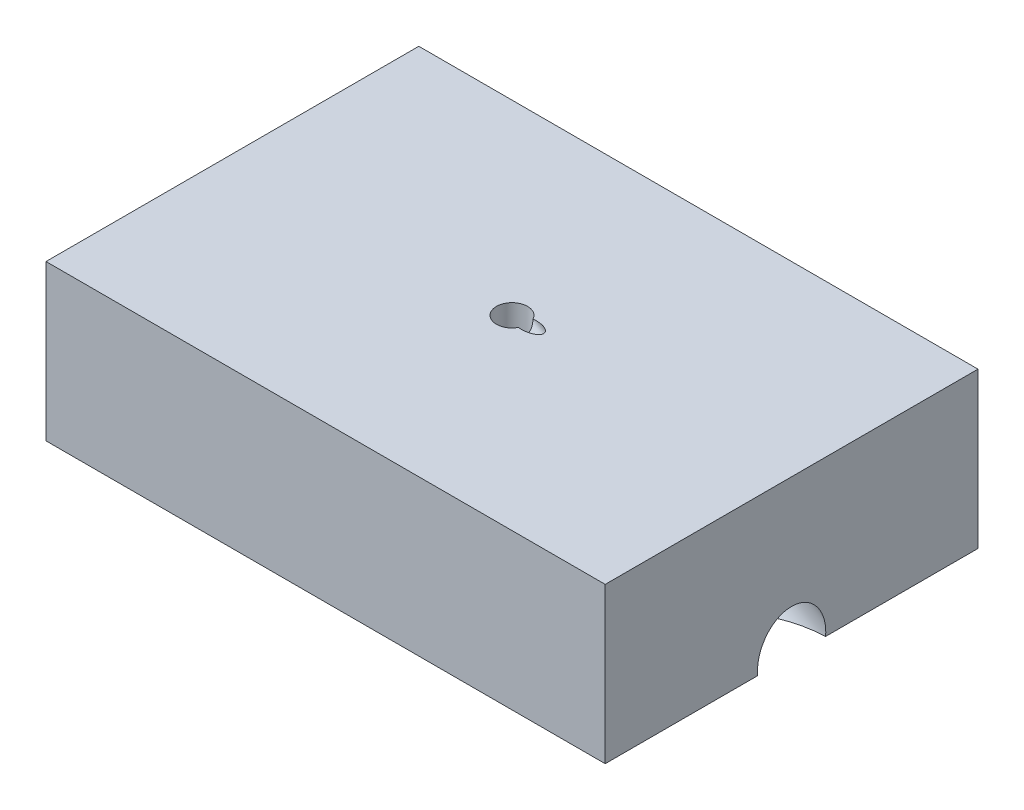
ISO-10303-21;
HEADER;
FILE_DESCRIPTION(('STEP AP214'),'2;1');
FILE_NAME('part.step','',(''),(''),'','','');
FILE_SCHEMA(('AUTOMOTIVE_DESIGN { 1 0 10303 214 1 1 1 1 }'));
ENDSEC;
DATA;
#1=APPLICATION_CONTEXT('core data for automotive mechanical design processes');
#2=APPLICATION_PROTOCOL_DEFINITION('international standard','automotive_design',2000,#1);
#3=PRODUCT_CONTEXT('',#1,'mechanical');
#4=PRODUCT('Part','Part','',(#3));
#5=PRODUCT_RELATED_PRODUCT_CATEGORY('part','',(#4));
#6=PRODUCT_DEFINITION_FORMATION('','',#4);
#7=PRODUCT_DEFINITION_CONTEXT('part definition',#1,'design');
#8=PRODUCT_DEFINITION('design','',#6,#7);
#9=PRODUCT_DEFINITION_SHAPE('','',#8);
#10=(LENGTH_UNIT() NAMED_UNIT(*) SI_UNIT(.MILLI.,.METRE.));
#11=(NAMED_UNIT(*) PLANE_ANGLE_UNIT() SI_UNIT($,.RADIAN.));
#12=(NAMED_UNIT(*) SI_UNIT($,.STERADIAN.) SOLID_ANGLE_UNIT());
#13=UNCERTAINTY_MEASURE_WITH_UNIT(LENGTH_MEASURE(1.E-05),#10,'distance_accuracy_value','');
#14=(GEOMETRIC_REPRESENTATION_CONTEXT(3) GLOBAL_UNCERTAINTY_ASSIGNED_CONTEXT((#13)) GLOBAL_UNIT_ASSIGNED_CONTEXT((#10,
#11,#12)) REPRESENTATION_CONTEXT('',''));
#15=CARTESIAN_POINT('',(0.,0.,0.));
#16=DIRECTION('',(0.,0.,1.));
#17=DIRECTION('',(1.,0.,0.));
#18=AXIS2_PLACEMENT_3D('',#15,#16,#17);
#19=CARTESIAN_POINT('',(-45.,25.,30.));
#20=DIRECTION('',(1.,0.,0.));
#21=DIRECTION('',(0.,0.,-1.));
#22=AXIS2_PLACEMENT_3D('',#19,#20,#21);
#23=PLANE('',#22);
#24=DIRECTION('',(0.,0.,1.));
#25=VECTOR('',#24,1.);
#26=CARTESIAN_POINT('',(-45.,0.,30.));
#27=LINE('',#26,#25);
#28=CARTESIAN_POINT('',(-45.,0.,-30.));
#29=VERTEX_POINT('',#28);
#30=CARTESIAN_POINT('',(-45.,0.,30.));
#31=VERTEX_POINT('',#30);
#32=EDGE_CURVE('E98',#29,#31,#27,.T.);
#33=ORIENTED_EDGE('',*,*,#32,.T.);
#34=DIRECTION('',(0.,-1.,0.));
#35=VECTOR('',#34,1.);
#36=CARTESIAN_POINT('',(-45.,25.,30.));
#37=LINE('',#36,#35);
#38=CARTESIAN_POINT('',(-45.,25.,30.));
#39=VERTEX_POINT('',#38);
#40=EDGE_CURVE('E42',#39,#31,#37,.T.);
#41=ORIENTED_EDGE('',*,*,#40,.F.);
#42=DIRECTION('',(0.,0.,1.));
#43=VECTOR('',#42,1.);
#44=CARTESIAN_POINT('',(-45.,25.,30.));
#45=LINE('',#44,#43);
#46=CARTESIAN_POINT('',(-45.,25.,-30.));
#47=VERTEX_POINT('',#46);
#48=EDGE_CURVE('E109',#47,#39,#45,.T.);
#49=ORIENTED_EDGE('',*,*,#48,.F.);
#50=DIRECTION('',(0.,-1.,0.));
#51=VECTOR('',#50,1.);
#52=CARTESIAN_POINT('',(-45.,25.,-30.));
#53=LINE('',#52,#51);
#54=EDGE_CURVE('E118',#47,#29,#53,.T.);
#55=ORIENTED_EDGE('',*,*,#54,.T.);
#56=EDGE_LOOP('',(#33,#41,#49,#55));
#57=FACE_BOUND('',#56,.T.);
#58=ADVANCED_FACE('F35',(#57),#23,.F.);
#59=CARTESIAN_POINT('',(45.,25.,30.));
#60=DIRECTION('',(0.,0.,-1.));
#61=DIRECTION('',(-1.,0.,0.));
#62=AXIS2_PLACEMENT_3D('',#59,#60,#61);
#63=PLANE('',#62);
#64=DIRECTION('',(1.,0.,0.));
#65=VECTOR('',#64,1.);
#66=CARTESIAN_POINT('',(45.,0.,30.));
#67=LINE('',#66,#65);
#68=CARTESIAN_POINT('',(45.,0.,30.));
#69=VERTEX_POINT('',#68);
#70=EDGE_CURVE('E102',#31,#69,#67,.T.);
#71=ORIENTED_EDGE('',*,*,#70,.T.);
#72=DIRECTION('',(0.,-1.,0.));
#73=VECTOR('',#72,1.);
#74=CARTESIAN_POINT('',(45.,25.,30.));
#75=LINE('',#74,#73);
#76=CARTESIAN_POINT('',(45.,25.,30.));
#77=VERTEX_POINT('',#76);
#78=EDGE_CURVE('E131',#77,#69,#75,.T.);
#79=ORIENTED_EDGE('',*,*,#78,.F.);
#80=DIRECTION('',(1.,0.,0.));
#81=VECTOR('',#80,1.);
#82=CARTESIAN_POINT('',(45.,25.,30.));
#83=LINE('',#82,#81);
#84=EDGE_CURVE('E112',#39,#77,#83,.T.);
#85=ORIENTED_EDGE('',*,*,#84,.F.);
#86=ORIENTED_EDGE('',*,*,#40,.T.);
#87=EDGE_LOOP('',(#71,#79,#85,#86));
#88=FACE_BOUND('',#87,.T.);
#89=ADVANCED_FACE('F136',(#88),#63,.F.);
#90=CARTESIAN_POINT('',(45.,25.,30.));
#91=DIRECTION('',(-1.,0.,0.));
#92=DIRECTION('',(0.,0.,1.));
#93=AXIS2_PLACEMENT_3D('',#90,#91,#92);
#94=PLANE('',#93);
#95=CARTESIAN_POINT('',(45.,0.577350269189422,0.));
#96=DIRECTION('',(-1.,0.,0.));
#97=DIRECTION('',(0.,-1.,0.));
#98=AXIS2_PLACEMENT_3D('',#95,#96,#97);
#99=ELLIPSE('',#98,6.3508529610859,5.5);
#100=CARTESIAN_POINT('',(45.,0.,-5.47722557505167));
#101=VERTEX_POINT('',#100);
#102=CARTESIAN_POINT('',(45.,0.,5.47722557505168));
#103=VERTEX_POINT('',#102);
#104=EDGE_CURVE('E54',#101,#103,#99,.F.);
#105=ORIENTED_EDGE('',*,*,#104,.F.);
#106=DIRECTION('',(0.,0.,-1.));
#107=VECTOR('',#106,1.);
#108=CARTESIAN_POINT('',(45.,0.,30.));
#109=LINE('',#108,#107);
#110=CARTESIAN_POINT('',(45.,0.,-30.));
#111=VERTEX_POINT('',#110);
#112=EDGE_CURVE('E121',#101,#111,#109,.T.);
#113=ORIENTED_EDGE('',*,*,#112,.T.);
#114=DIRECTION('',(0.,-1.,0.));
#115=VECTOR('',#114,1.);
#116=CARTESIAN_POINT('',(45.,25.,-30.));
#117=LINE('',#116,#115);
#118=CARTESIAN_POINT('',(45.,25.,-30.));
#119=VERTEX_POINT('',#118);
#120=EDGE_CURVE('E128',#119,#111,#117,.T.);
#121=ORIENTED_EDGE('',*,*,#120,.F.);
#122=DIRECTION('',(0.,0.,-1.));
#123=VECTOR('',#122,1.);
#124=CARTESIAN_POINT('',(45.,25.,30.));
#125=LINE('',#124,#123);
#126=EDGE_CURVE('E115',#77,#119,#125,.T.);
#127=ORIENTED_EDGE('',*,*,#126,.F.);
#128=ORIENTED_EDGE('',*,*,#78,.T.);
#129=EDGE_CURVE('E122',#69,#103,#109,.T.);
#130=ORIENTED_EDGE('',*,*,#129,.T.);
#131=EDGE_LOOP('',(#105,#113,#121,#127,#128,#130));
#132=FACE_BOUND('',#131,.T.);
#133=ADVANCED_FACE('F149',(#132),#94,.F.);
#134=CARTESIAN_POINT('',(45.,25.,-30.));
#135=DIRECTION('',(0.,0.,1.));
#136=DIRECTION('',(1.,0.,0.));
#137=AXIS2_PLACEMENT_3D('',#134,#135,#136);
#138=PLANE('',#137);
#139=DIRECTION('',(-1.,0.,0.));
#140=VECTOR('',#139,1.);
#141=CARTESIAN_POINT('',(45.,0.,-30.));
#142=LINE('',#141,#140);
#143=EDGE_CURVE('E113',#111,#29,#142,.T.);
#144=ORIENTED_EDGE('',*,*,#143,.T.);
#145=ORIENTED_EDGE('',*,*,#54,.F.);
#146=DIRECTION('',(-1.,0.,0.));
#147=VECTOR('',#146,1.);
#148=CARTESIAN_POINT('',(45.,25.,-30.));
#149=LINE('',#148,#147);
#150=EDGE_CURVE('E117',#119,#47,#149,.T.);
#151=ORIENTED_EDGE('',*,*,#150,.F.);
#152=ORIENTED_EDGE('',*,*,#120,.T.);
#153=EDGE_LOOP('',(#144,#145,#151,#152));
#154=FACE_BOUND('',#153,.T.);
#155=ADVANCED_FACE('F154',(#154),#138,.F.);
#156=CARTESIAN_POINT('',(0.,25.,0.));
#157=DIRECTION('',(0.,1.,0.));
#158=DIRECTION('',(0.,0.,1.));
#159=AXIS2_PLACEMENT_3D('',#156,#157,#158);
#160=PLANE('',#159);
#161=CARTESIAN_POINT('',(2.69872981077816,25.,0.));
#162=DIRECTION('',(0.,1.,0.));
#163=DIRECTION('',(1.,0.,0.));
#164=AXIS2_PLACEMENT_3D('',#161,#162,#163);
#165=ELLIPSE('',#164,2.39999999999998,1.2);
#166=CARTESIAN_POINT('',(2.20691427781334,25.,1.1745336820984));
#167=VERTEX_POINT('',#166);
#168=CARTESIAN_POINT('',(2.20691427781334,25.,-1.1745336820984));
#169=VERTEX_POINT('',#168);
#170=EDGE_CURVE('E48',#167,#169,#165,.T.);
#171=ORIENTED_EDGE('',*,*,#170,.F.);
#172=CARTESIAN_POINT('',(0.,25.,0.));
#173=DIRECTION('',(0.,1.,0.));
#174=DIRECTION('',(0.,0.,1.));
#175=AXIS2_PLACEMENT_3D('',#172,#173,#174);
#176=CIRCLE('',#175,2.5);
#177=EDGE_CURVE('E94',#169,#167,#176,.T.);
#178=ORIENTED_EDGE('',*,*,#177,.F.);
#179=EDGE_LOOP('',(#171,#178));
#180=FACE_BOUND('',#179,.T.);
#181=ORIENTED_EDGE('',*,*,#48,.T.);
#182=ORIENTED_EDGE('',*,*,#84,.T.);
#183=ORIENTED_EDGE('',*,*,#126,.T.);
#184=ORIENTED_EDGE('',*,*,#150,.T.);
#185=EDGE_LOOP('',(#181,#182,#183,#184));
#186=FACE_BOUND('',#185,.T.);
#187=ADVANCED_FACE('F92',(#180,#186),#160,.T.);
#188=CARTESIAN_POINT('',(0.,0.,0.));
#189=DIRECTION('',(0.,1.,0.));
#190=DIRECTION('',(0.,0.,1.));
#191=AXIS2_PLACEMENT_3D('',#188,#189,#190);
#192=PLANE('',#191);
#193=CARTESIAN_POINT('',(45.9999999999996,0.,0.));
#194=DIRECTION('',(0.,1.,0.));
#195=DIRECTION('',(1.,0.,0.));
#196=AXIS2_PLACEMENT_3D('',#193,#194,#195);
#197=ELLIPSE('',#196,10.9999999999999,5.5);
#198=EDGE_CURVE('E11',#103,#101,#197,.F.);
#199=ORIENTED_EDGE('',*,*,#198,.F.);
#200=ORIENTED_EDGE('',*,*,#129,.F.);
#201=ORIENTED_EDGE('',*,*,#70,.F.);
#202=ORIENTED_EDGE('',*,*,#32,.F.);
#203=ORIENTED_EDGE('',*,*,#143,.F.);
#204=ORIENTED_EDGE('',*,*,#112,.F.);
#205=EDGE_LOOP('',(#199,#200,#201,#202,#203,#204));
#206=FACE_BOUND('',#205,.T.);
#207=CARTESIAN_POINT('',(0.,0.,0.));
#208=DIRECTION('',(0.,1.,0.));
#209=DIRECTION('',(0.,0.,1.));
#210=AXIS2_PLACEMENT_3D('',#207,#208,#209);
#211=CIRCLE('',#210,6.75);
#212=CARTESIAN_POINT('',(0.,0.,6.75));
#213=VERTEX_POINT('',#212);
#214=EDGE_CURVE('E267',#213,#213,#211,.T.);
#215=ORIENTED_EDGE('',*,*,#214,.T.);
#216=EDGE_LOOP('',(#215));
#217=FACE_BOUND('',#216,.T.);
#218=ADVANCED_FACE('F144',(#206,#217),#192,.F.);
#219=CARTESIAN_POINT('',(0.,19.8,0.));
#220=DIRECTION('',(0.,1.,0.));
#221=DIRECTION('',(0.,0.,1.));
#222=AXIS2_PLACEMENT_3D('',#219,#220,#221);
#223=CYLINDRICAL_SURFACE('',#222,2.5);
#224=CARTESIAN_POINT('',(0.,19.8,0.));
#225=DIRECTION('',(0.,1.,0.));
#226=DIRECTION('',(0.,0.,1.));
#227=AXIS2_PLACEMENT_3D('',#224,#225,#226);
#228=CIRCLE('',#227,2.5);
#229=CARTESIAN_POINT('',(0.,19.8,2.5));
#230=VERTEX_POINT('',#229);
#231=EDGE_CURVE('E99',#230,#230,#228,.F.);
#232=ORIENTED_EDGE('',*,*,#231,.T.);
#233=EDGE_LOOP('',(#232));
#234=FACE_BOUND('',#233,.T.);
#235=ORIENTED_EDGE('',*,*,#177,.T.);
#236=CARTESIAN_POINT('',(2.20691427781334,25.,1.1745336820984));
#237=CARTESIAN_POINT('',(2.2114580032013,24.950294207067,1.16598103158284));
#238=CARTESIAN_POINT('',(2.21701633731823,24.9010488195081,1.15543307429402));
#239=CARTESIAN_POINT('',(2.22981323360441,24.8037651276555,1.13054740691817));
#240=CARTESIAN_POINT('',(2.23705115477844,24.7557263705965,1.11621114230653));
#241=CARTESIAN_POINT('',(2.25297207058267,24.660446557753,1.08371872748737));
#242=CARTESIAN_POINT('',(2.26167374655636,24.6132258600294,1.06551226931522));
#243=CARTESIAN_POINT('',(2.28010218713846,24.5205442411972,1.02548542872307));
#244=CARTESIAN_POINT('',(2.28982908817106,24.4750835553926,1.00366456512167));
#245=CARTESIAN_POINT('',(2.31007917183898,24.3857346028321,0.956142588546171));
#246=CARTESIAN_POINT('',(2.32060995116835,24.3418691977724,0.930401348160739));
#247=CARTESIAN_POINT('',(2.34200399002522,24.2566636999363,0.875154310543319));
#248=CARTESIAN_POINT('',(2.35286746130809,24.2153252678953,0.84564607614256));
#249=CARTESIAN_POINT('',(2.38526562114691,24.096328173519,0.751597769028644));
#250=CARTESIAN_POINT('',(2.40677777788242,24.0229750443494,0.681167335803824));
#251=CARTESIAN_POINT('',(2.43666513559053,23.9250227308073,0.560811161433725));
#252=CARTESIAN_POINT('',(2.44648073140726,23.893661485473,0.516689339779733));
#253=CARTESIAN_POINT('',(2.46424957662403,23.8377708926772,0.423910388161317));
#254=CARTESIAN_POINT('',(2.47220410131206,23.8132368647091,0.375256395992527));
#255=CARTESIAN_POINT('',(2.48552823344153,23.772529367267,0.273504164687324));
#256=CARTESIAN_POINT('',(2.49086740646112,23.7564541792531,0.22036166550387));
#257=CARTESIAN_POINT('',(2.49809025949106,23.7347759017955,0.111754969447047));
#258=CARTESIAN_POINT('',(2.49997861309161,23.7291586485358,0.0562940169049124));
#259=CARTESIAN_POINT('',(2.50001794461515,23.7290435672506,-0.046363705683551));
#260=CARTESIAN_POINT('',(2.49868209199362,23.7330189381561,-0.0935651545930636));
#261=CARTESIAN_POINT('',(2.49346640874587,23.7486439020961,-0.186530092741541));
#262=CARTESIAN_POINT('',(2.48958574696,23.7602960024315,-0.23229310705451));
#263=CARTESIAN_POINT('',(2.47978877869986,23.790025522993,-0.320262377499521));
#264=CARTESIAN_POINT('',(2.47391947785664,23.8079548673609,-0.362524971884933));
#265=CARTESIAN_POINT('',(2.46060075712816,23.8492173246079,-0.444017061594884));
#266=CARTESIAN_POINT('',(2.45315093634856,23.8725518086233,-0.483245783935219));
#267=CARTESIAN_POINT('',(2.43222249093764,23.939294724941,-0.581500397455913));
#268=CARTESIAN_POINT('',(2.41784623062884,23.9862439337811,-0.637933695801889));
#269=CARTESIAN_POINT('',(2.387827299378,24.088414704097,-0.742465525394206));
#270=CARTESIAN_POINT('',(2.37218026893942,24.1436653470791,-0.790533419793124));
#271=CARTESIAN_POINT('',(2.33515090686146,24.2819017878653,-0.895093822613803));
#272=CARTESIAN_POINT('',(2.3138015506721,24.3675565206623,-0.94806286555296));
#273=CARTESIAN_POINT('',(2.27413655287745,24.5466838901309,-1.03960511165272));
#274=CARTESIAN_POINT('',(2.25581678468022,24.6401456271597,-1.07819798786312));
#275=CARTESIAN_POINT('',(2.23347872582615,24.7793707281361,-1.12330314310584));
#276=CARTESIAN_POINT('',(2.22715672858407,24.8229050174316,-1.13574920929196));
#277=CARTESIAN_POINT('',(2.2159226535372,24.9108311954916,-1.15751170416048));
#278=CARTESIAN_POINT('',(2.21100778773984,24.9552211998057,-1.16683432774591));
#279=CARTESIAN_POINT('',(2.20691427781334,25.,-1.1745336820984));
#280=B_SPLINE_CURVE_WITH_KNOTS('',3,(#236,#237,#238,#239,#240,#241,#242,#243,#244,#245,#246,
#247,#248,#249,#250,#251,#252,#253,#254,#255,#256,#257,#258,#259,#260,#261,#262,#263,#264,#265,
#266,#267,#268,#269,#270,#271,#272,#273,#274,#275,#276,#277,#278,#279),.UNSPECIFIED.,.F.,.F.,(4,
2,2,2,2,2,2,2,2,2,2,2,2,2,2,2,2,2,2,2,2,4),(0.,0.151835050917763,0.303612250745465,
0.45749833139975,0.611404915211038,0.767008319181663,0.922712910509833,1.23169460369647,
1.39624880912594,1.56068992232513,1.72700165706656,1.89308798140736,2.03452033611949,
2.17599890704892,2.31434294824868,2.45272212206066,2.67586568100736,2.89981001168817,
3.20710744465019,3.51398279833253,3.65101928614228,3.7877823500364),.UNSPECIFIED.);
#281=EDGE_CURVE('E83',#167,#169,#280,.T.);
#282=ORIENTED_EDGE('',*,*,#281,.T.);
#283=EDGE_LOOP('',(#235,#282));
#284=FACE_BOUND('',#283,.T.);
#285=ADVANCED_FACE('F97',(#234,#284),#223,.F.);
#286=CARTESIAN_POINT('',(0.,19.8,0.));
#287=DIRECTION('',(0.,1.,0.));
#288=DIRECTION('',(0.,0.,1.));
#289=AXIS2_PLACEMENT_3D('',#286,#287,#288);
#290=PLANE('',#289);
#291=CARTESIAN_POINT('',(0.,19.8,0.));
#292=DIRECTION('',(0.,1.,0.));
#293=DIRECTION('',(0.,0.,1.));
#294=AXIS2_PLACEMENT_3D('',#291,#292,#293);
#295=CIRCLE('',#294,6.25);
#296=CARTESIAN_POINT('',(0.,19.8,6.25));
#297=VERTEX_POINT('',#296);
#298=EDGE_CURVE('E105',#297,#297,#295,.T.);
#299=ORIENTED_EDGE('',*,*,#298,.F.);
#300=EDGE_LOOP('',(#299));
#301=FACE_BOUND('',#300,.T.);
#302=ORIENTED_EDGE('',*,*,#231,.F.);
#303=EDGE_LOOP('',(#302));
#304=FACE_BOUND('',#303,.T.);
#305=ADVANCED_FACE('F218',(#301,#304),#290,.F.);
#306=CARTESIAN_POINT('',(0.,17.8,0.));
#307=DIRECTION('',(0.,1.,0.));
#308=DIRECTION('',(0.,0.,1.));
#309=AXIS2_PLACEMENT_3D('',#306,#307,#308);
#310=CYLINDRICAL_SURFACE('',#309,6.25);
#311=CARTESIAN_POINT('',(0.,17.8,0.));
#312=DIRECTION('',(0.,1.,0.));
#313=DIRECTION('',(0.,0.,1.));
#314=AXIS2_PLACEMENT_3D('',#311,#312,#313);
#315=CIRCLE('',#314,6.25);
#316=CARTESIAN_POINT('',(0.,17.8,6.25));
#317=VERTEX_POINT('',#316);
#318=EDGE_CURVE('E266',#317,#317,#315,.F.);
#319=ORIENTED_EDGE('',*,*,#318,.T.);
#320=EDGE_LOOP('',(#319));
#321=FACE_BOUND('',#320,.T.);
#322=ORIENTED_EDGE('',*,*,#298,.T.);
#323=EDGE_LOOP('',(#322));
#324=FACE_BOUND('',#323,.T.);
#325=ADVANCED_FACE('F248',(#321,#324),#310,.F.);
#326=CARTESIAN_POINT('',(0.,17.8,0.));
#327=DIRECTION('',(0.,1.,0.));
#328=DIRECTION('',(0.,0.,1.));
#329=AXIS2_PLACEMENT_3D('',#326,#327,#328);
#330=PLANE('',#329);
#331=CARTESIAN_POINT('',(0.,17.8,0.));
#332=DIRECTION('',(0.,1.,0.));
#333=DIRECTION('',(0.,0.,1.));
#334=AXIS2_PLACEMENT_3D('',#331,#332,#333);
#335=CIRCLE('',#334,6.75);
#336=CARTESIAN_POINT('',(0.,17.8,6.75));
#337=VERTEX_POINT('',#336);
#338=EDGE_CURVE('E263',#337,#337,#335,.T.);
#339=ORIENTED_EDGE('',*,*,#338,.F.);
#340=EDGE_LOOP('',(#339));
#341=FACE_BOUND('',#340,.T.);
#342=ORIENTED_EDGE('',*,*,#318,.F.);
#343=EDGE_LOOP('',(#342));
#344=FACE_BOUND('',#343,.T.);
#345=ADVANCED_FACE('F251',(#341,#344),#330,.F.);
#346=CARTESIAN_POINT('',(0.,0.,0.));
#347=DIRECTION('',(0.,1.,0.));
#348=DIRECTION('',(0.,0.,1.));
#349=AXIS2_PLACEMENT_3D('',#346,#347,#348);
#350=CYLINDRICAL_SURFACE('',#349,6.75);
#351=ORIENTED_EDGE('',*,*,#214,.F.);
#352=EDGE_LOOP('',(#351));
#353=FACE_BOUND('',#352,.T.);
#354=ORIENTED_EDGE('',*,*,#338,.T.);
#355=EDGE_LOOP('',(#354));
#356=FACE_BOUND('',#355,.T.);
#357=ADVANCED_FACE('F181',(#353,#356),#350,.F.);
#358=CARTESIAN_POINT('',(19.9617282046543,15.0332032302754,0.));
#359=DIRECTION('',(0.866025403784436,-0.500000000000004,0.));
#360=DIRECTION('',(0.500000000000004,0.866025403784436,0.));
#361=AXIS2_PLACEMENT_3D('',#358,#359,#360);
#362=CYLINDRICAL_SURFACE('',#361,5.5);
#363=CARTESIAN_POINT('',(19.9617282046543,15.0332032302754,0.));
#364=DIRECTION('',(-0.866025403784436,0.500000000000004,0.));
#365=DIRECTION('',(-0.500000000000004,-0.866025403784436,0.));
#366=AXIS2_PLACEMENT_3D('',#363,#364,#365);
#367=CIRCLE('',#366,5.5);
#368=CARTESIAN_POINT('',(17.2117282046542,10.270063509461,0.));
#369=VERTEX_POINT('',#368);
#370=EDGE_CURVE('E95',#369,#369,#367,.T.);
#371=ORIENTED_EDGE('',*,*,#370,.T.);
#372=EDGE_LOOP('',(#371));
#373=FACE_BOUND('',#372,.T.);
#374=ORIENTED_EDGE('',*,*,#104,.T.);
#375=ORIENTED_EDGE('',*,*,#198,.T.);
#376=EDGE_LOOP('',(#374,#375));
#377=FACE_BOUND('',#376,.T.);
#378=ADVANCED_FACE('F197',(#373,#377),#362,.F.);
#379=CARTESIAN_POINT('',(19.9617282046543,15.0332032302754,0.));
#380=DIRECTION('',(-0.866025403784436,0.500000000000004,0.));
#381=DIRECTION('',(-0.500000000000004,-0.866025403784436,0.));
#382=AXIS2_PLACEMENT_3D('',#379,#380,#381);
#383=PLANE('',#382);
#384=CARTESIAN_POINT('',(19.9617282046543,15.0332032302755,0.));
#385=DIRECTION('',(0.866025403784436,-0.500000000000004,0.));
#386=DIRECTION('',(0.500000000000004,0.866025403784436,0.));
#387=AXIS2_PLACEMENT_3D('',#384,#385,#386);
#388=CIRCLE('',#387,1.2);
#389=CARTESIAN_POINT('',(20.5617282046543,16.0724337148168,0.));
#390=VERTEX_POINT('',#389);
#391=EDGE_CURVE('E89',#390,#390,#388,.T.);
#392=ORIENTED_EDGE('',*,*,#391,.F.);
#393=EDGE_LOOP('',(#392));
#394=FACE_BOUND('',#393,.T.);
#395=ORIENTED_EDGE('',*,*,#370,.F.);
#396=EDGE_LOOP('',(#395));
#397=FACE_BOUND('',#396,.T.);
#398=ADVANCED_FACE('F202',(#394,#397),#383,.F.);
#399=CARTESIAN_POINT('',(-33.0753175473053,45.6541558721921,0.));
#400=DIRECTION('',(0.866025403784436,-0.500000000000004,0.));
#401=DIRECTION('',(0.500000000000004,0.866025403784436,0.));
#402=AXIS2_PLACEMENT_3D('',#399,#400,#401);
#403=CYLINDRICAL_SURFACE('',#402,1.2);
#404=ORIENTED_EDGE('',*,*,#170,.T.);
#405=ORIENTED_EDGE('',*,*,#281,.F.);
#406=EDGE_LOOP('',(#404,#405));
#407=FACE_BOUND('',#406,.T.);
#408=ORIENTED_EDGE('',*,*,#391,.T.);
#409=EDGE_LOOP('',(#408));
#410=FACE_BOUND('',#409,.T.);
#411=ADVANCED_FACE('F84',(#407,#410),#403,.F.);
#412=CLOSED_SHELL('',(#58,#89,#133,#155,#187,#218,#285,#305,#325,#345,#357,#378,#398,#411));
#413=MANIFOLD_SOLID_BREP('B2',#412);
#414=ADVANCED_BREP_SHAPE_REPRESENTATION('',(#18,#413),#14);
#415=SHAPE_DEFINITION_REPRESENTATION(#9,#414);
ENDSEC;
END-ISO-10303-21;
